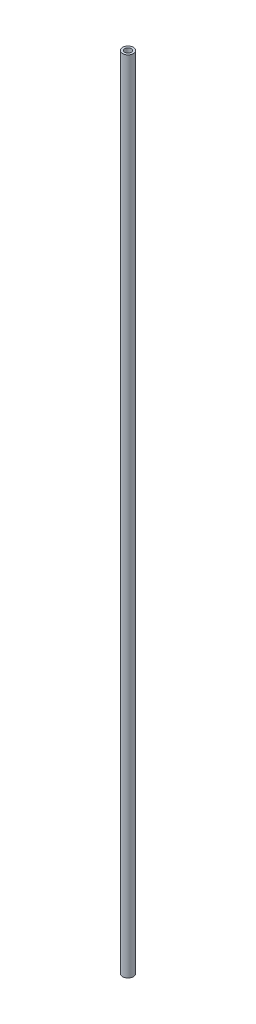
ISO-10303-21;
HEADER;
FILE_DESCRIPTION(('STEP AP214'),'2;1');
FILE_NAME('part.step','',(''),(''),'','','');
FILE_SCHEMA(('AUTOMOTIVE_DESIGN { 1 0 10303 214 1 1 1 1 }'));
ENDSEC;
DATA;
#1=APPLICATION_CONTEXT('core data for automotive mechanical design processes');
#2=APPLICATION_PROTOCOL_DEFINITION('international standard','automotive_design',2000,#1);
#3=PRODUCT_CONTEXT('',#1,'mechanical');
#4=PRODUCT('Part','Part','',(#3));
#5=PRODUCT_RELATED_PRODUCT_CATEGORY('part','',(#4));
#6=PRODUCT_DEFINITION_FORMATION('','',#4);
#7=PRODUCT_DEFINITION_CONTEXT('part definition',#1,'design');
#8=PRODUCT_DEFINITION('design','',#6,#7);
#9=PRODUCT_DEFINITION_SHAPE('','',#8);
#10=(LENGTH_UNIT() NAMED_UNIT(*) SI_UNIT(.MILLI.,.METRE.));
#11=(NAMED_UNIT(*) PLANE_ANGLE_UNIT() SI_UNIT($,.RADIAN.));
#12=(NAMED_UNIT(*) SI_UNIT($,.STERADIAN.) SOLID_ANGLE_UNIT());
#13=UNCERTAINTY_MEASURE_WITH_UNIT(LENGTH_MEASURE(1.E-05),#10,'distance_accuracy_value','');
#14=(GEOMETRIC_REPRESENTATION_CONTEXT(3) GLOBAL_UNCERTAINTY_ASSIGNED_CONTEXT((#13)) GLOBAL_UNIT_ASSIGNED_CONTEXT((#10,
#11,#12)) REPRESENTATION_CONTEXT('',''));
#15=CARTESIAN_POINT('',(0.,0.,0.));
#16=DIRECTION('',(0.,0.,1.));
#17=DIRECTION('',(1.,0.,0.));
#18=AXIS2_PLACEMENT_3D('',#15,#16,#17);
#19=CARTESIAN_POINT('',(0.,457.2,0.));
#20=DIRECTION('',(0.,1.,0.));
#21=DIRECTION('',(0.,0.,0.999999999999998));
#22=AXIS2_PLACEMENT_3D('',#19,#20,#21);
#23=PLANE('',#22);
#24=CARTESIAN_POINT('',(0.,457.2,0.));
#25=DIRECTION('',(0.,1.,0.));
#26=DIRECTION('',(0.,0.,0.999999999999998));
#27=AXIS2_PLACEMENT_3D('',#24,#25,#26);
#28=CIRCLE('',#27,6.223);
#29=CARTESIAN_POINT('',(0.,457.2,6.22299999999999));
#30=VERTEX_POINT('',#29);
#31=EDGE_CURVE('E10',#30,#30,#28,.T.);
#32=ORIENTED_EDGE('',*,*,#31,.T.);
#33=EDGE_LOOP('',(#32));
#34=FACE_BOUND('',#33,.T.);
#35=CARTESIAN_POINT('',(0.,457.2,0.));
#36=DIRECTION('',(0.,1.,0.));
#37=DIRECTION('',(0.,0.,0.999999999999998));
#38=AXIS2_PLACEMENT_3D('',#35,#36,#37);
#39=CIRCLE('',#38,3.683);
#40=CARTESIAN_POINT('',(0.,457.2,3.68299999999999));
#41=VERTEX_POINT('',#40);
#42=EDGE_CURVE('E50',#41,#41,#39,.T.);
#43=ORIENTED_EDGE('',*,*,#42,.F.);
#44=EDGE_LOOP('',(#43));
#45=FACE_BOUND('',#44,.T.);
#46=ADVANCED_FACE('F36',(#34,#45),#23,.T.);
#47=CARTESIAN_POINT('',(-3.10862446895044E-12,-457.200000000002,1.11022302462516E-12));
#48=DIRECTION('',(0.,1.,0.));
#49=DIRECTION('',(0.,0.,0.999999999999998));
#50=AXIS2_PLACEMENT_3D('',#47,#48,#49);
#51=PLANE('',#50);
#52=CARTESIAN_POINT('',(-3.10862446895044E-12,-457.200000000002,1.11022302462516E-12));
#53=DIRECTION('',(0.,1.,0.));
#54=DIRECTION('',(0.,0.,0.999999999999998));
#55=AXIS2_PLACEMENT_3D('',#52,#53,#54);
#56=CIRCLE('',#55,6.223);
#57=CARTESIAN_POINT('',(-3.10689723947988E-12,-457.200000000002,6.2230000000011));
#58=VERTEX_POINT('',#57);
#59=EDGE_CURVE('E40',#58,#58,#56,.T.);
#60=ORIENTED_EDGE('',*,*,#59,.F.);
#61=EDGE_LOOP('',(#60));
#62=FACE_BOUND('',#61,.T.);
#63=CARTESIAN_POINT('',(-3.10862446895044E-12,-457.200000000002,1.11022302462516E-12));
#64=DIRECTION('',(0.,1.,0.));
#65=DIRECTION('',(0.,0.,0.999999999999998));
#66=AXIS2_PLACEMENT_3D('',#63,#64,#65);
#67=CIRCLE('',#66,3.683);
#68=CARTESIAN_POINT('',(-3.10760223110051E-12,-457.200000000002,3.6830000000011));
#69=VERTEX_POINT('',#68);
#70=EDGE_CURVE('E52',#69,#69,#67,.T.);
#71=ORIENTED_EDGE('',*,*,#70,.T.);
#72=EDGE_LOOP('',(#71));
#73=FACE_BOUND('',#72,.T.);
#74=ADVANCED_FACE('F63',(#62,#73),#51,.F.);
#75=CARTESIAN_POINT('',(0.,457.2,0.));
#76=DIRECTION('',(0.,-1.,0.));
#77=DIRECTION('',(0.,0.,-0.999999999999998));
#78=AXIS2_PLACEMENT_3D('',#75,#76,#77);
#79=CYLINDRICAL_SURFACE('',#78,6.223);
#80=ORIENTED_EDGE('',*,*,#31,.F.);
#81=EDGE_LOOP('',(#80));
#82=FACE_BOUND('',#81,.T.);
#83=ORIENTED_EDGE('',*,*,#59,.T.);
#84=EDGE_LOOP('',(#83));
#85=FACE_BOUND('',#84,.T.);
#86=ADVANCED_FACE('F38',(#82,#85),#79,.T.);
#87=CARTESIAN_POINT('',(0.,457.2,0.));
#88=DIRECTION('',(0.,-1.,0.));
#89=DIRECTION('',(0.,0.,-0.999999999999998));
#90=AXIS2_PLACEMENT_3D('',#87,#88,#89);
#91=CYLINDRICAL_SURFACE('',#90,3.683);
#92=ORIENTED_EDGE('',*,*,#42,.T.);
#93=EDGE_LOOP('',(#92));
#94=FACE_BOUND('',#93,.T.);
#95=ORIENTED_EDGE('',*,*,#70,.F.);
#96=EDGE_LOOP('',(#95));
#97=FACE_BOUND('',#96,.T.);
#98=ADVANCED_FACE('F59',(#94,#97),#91,.F.);
#99=CLOSED_SHELL('',(#46,#74,#86,#98));
#100=MANIFOLD_SOLID_BREP('B2',#99);
#101=ADVANCED_BREP_SHAPE_REPRESENTATION('',(#18,#100),#14);
#102=SHAPE_DEFINITION_REPRESENTATION(#9,#101);
ENDSEC;
END-ISO-10303-21;
